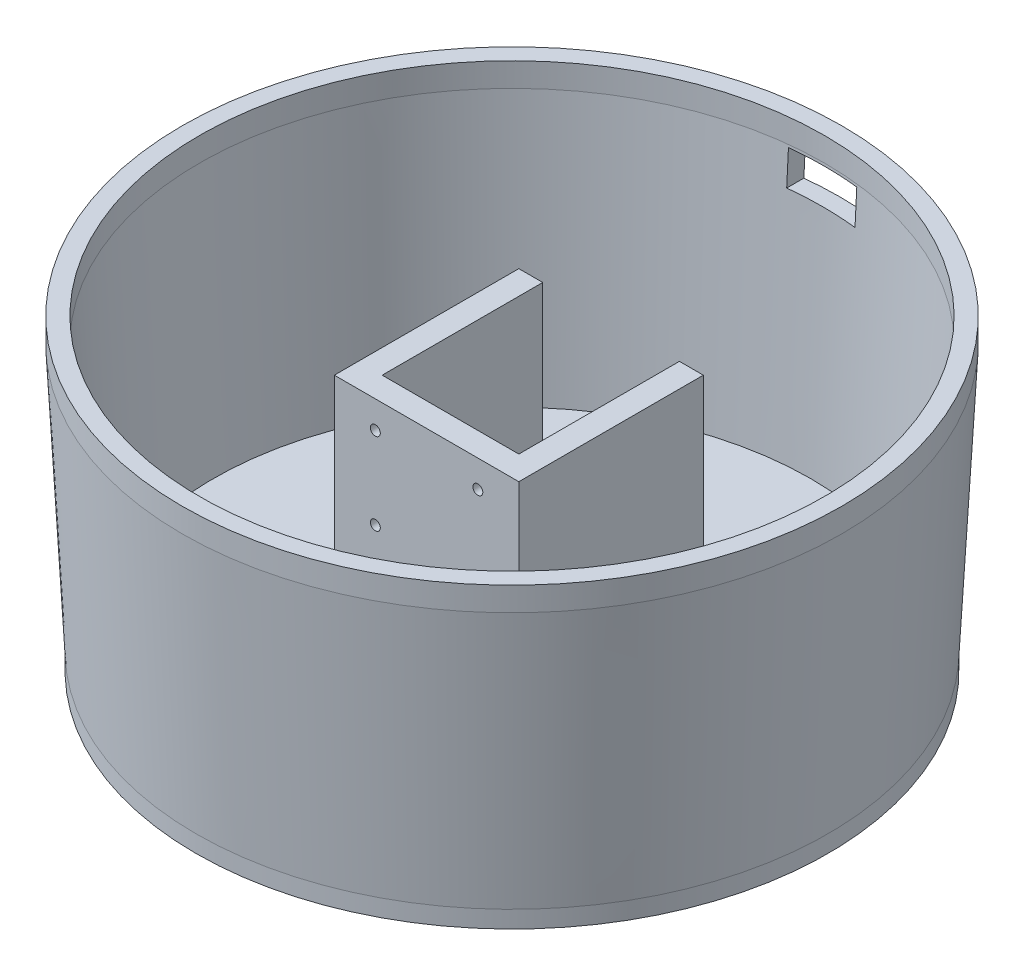
ISO-10303-21;
HEADER;
FILE_DESCRIPTION(('STEP AP214'),'2;1');
FILE_NAME('part.step','',(''),(''),'','','');
FILE_SCHEMA(('AUTOMOTIVE_DESIGN { 1 0 10303 214 1 1 1 1 }'));
ENDSEC;
DATA;
#1=APPLICATION_CONTEXT('core data for automotive mechanical design processes');
#2=APPLICATION_PROTOCOL_DEFINITION('international standard','automotive_design',2000,#1);
#3=PRODUCT_CONTEXT('',#1,'mechanical');
#4=PRODUCT('Part','Part','',(#3));
#5=PRODUCT_RELATED_PRODUCT_CATEGORY('part','',(#4));
#6=PRODUCT_DEFINITION_FORMATION('','',#4);
#7=PRODUCT_DEFINITION_CONTEXT('part definition',#1,'design');
#8=PRODUCT_DEFINITION('design','',#6,#7);
#9=PRODUCT_DEFINITION_SHAPE('','',#8);
#10=(LENGTH_UNIT() NAMED_UNIT(*) SI_UNIT(.MILLI.,.METRE.));
#11=(NAMED_UNIT(*) PLANE_ANGLE_UNIT() SI_UNIT($,.RADIAN.));
#12=(NAMED_UNIT(*) SI_UNIT($,.STERADIAN.) SOLID_ANGLE_UNIT());
#13=UNCERTAINTY_MEASURE_WITH_UNIT(LENGTH_MEASURE(1.E-05),#10,'distance_accuracy_value','');
#14=(GEOMETRIC_REPRESENTATION_CONTEXT(3) GLOBAL_UNCERTAINTY_ASSIGNED_CONTEXT((#13)) GLOBAL_UNIT_ASSIGNED_CONTEXT((#10,
#11,#12)) REPRESENTATION_CONTEXT('',''));
#15=CARTESIAN_POINT('',(0.,0.,0.));
#16=DIRECTION('',(0.,0.,1.));
#17=DIRECTION('',(1.,0.,0.));
#18=AXIS2_PLACEMENT_3D('',#15,#16,#17);
#19=CARTESIAN_POINT('',(0.,5.,0.));
#20=DIRECTION('',(0.,1.,0.));
#21=DIRECTION('',(0.,0.,1.));
#22=AXIS2_PLACEMENT_3D('',#19,#20,#21);
#23=PLANE('',#22);
#24=CARTESIAN_POINT('',(0.,5.,0.));
#25=DIRECTION('',(0.,1.,0.));
#26=DIRECTION('',(0.,0.,1.));
#27=AXIS2_PLACEMENT_3D('',#24,#25,#26);
#28=CIRCLE('',#27,15.2);
#29=CARTESIAN_POINT('',(0.,5.,15.2));
#30=VERTEX_POINT('',#29);
#31=EDGE_CURVE('E275',#30,#30,#28,.T.);
#32=ORIENTED_EDGE('',*,*,#31,.F.);
#33=EDGE_LOOP('',(#32));
#34=FACE_BOUND('',#33,.T.);
#35=CARTESIAN_POINT('',(0.,5.,0.));
#36=DIRECTION('',(0.,-1.,0.));
#37=DIRECTION('',(0.,0.,-1.));
#38=AXIS2_PLACEMENT_3D('',#35,#36,#37);
#39=CIRCLE('',#38,87.5);
#40=CARTESIAN_POINT('',(0.,5.,-87.5));
#41=VERTEX_POINT('',#40);
#42=EDGE_CURVE('E285',#41,#41,#39,.T.);
#43=ORIENTED_EDGE('',*,*,#42,.F.);
#44=EDGE_LOOP('',(#43));
#45=FACE_BOUND('',#44,.T.);
#46=DIRECTION('',(-1.,0.,0.));
#47=VECTOR('',#46,1.);
#48=CARTESIAN_POINT('',(-20.,5.,18.));
#49=LINE('',#48,#47);
#50=CARTESIAN_POINT('',(20.,5.,18.));
#51=VERTEX_POINT('',#50);
#52=CARTESIAN_POINT('',(-20.,5.,18.));
#53=VERTEX_POINT('',#52);
#54=EDGE_CURVE('E331',#51,#53,#49,.T.);
#55=ORIENTED_EDGE('',*,*,#54,.F.);
#56=DIRECTION('',(0.,0.,1.));
#57=VECTOR('',#56,1.);
#58=CARTESIAN_POINT('',(20.,5.,18.));
#59=LINE('',#58,#57);
#60=CARTESIAN_POINT('',(20.,5.,-29.));
#61=VERTEX_POINT('',#60);
#62=EDGE_CURVE('E334',#61,#51,#59,.T.);
#63=ORIENTED_EDGE('',*,*,#62,.F.);
#64=DIRECTION('',(-1.,0.,0.));
#65=VECTOR('',#64,1.);
#66=CARTESIAN_POINT('',(20.,5.,-29.));
#67=LINE('',#66,#65);
#68=CARTESIAN_POINT('',(27.,5.,-29.));
#69=VERTEX_POINT('',#68);
#70=EDGE_CURVE('E313',#69,#61,#67,.T.);
#71=ORIENTED_EDGE('',*,*,#70,.F.);
#72=DIRECTION('',(0.,0.,-1.));
#73=VECTOR('',#72,1.);
#74=CARTESIAN_POINT('',(27.,5.,25.));
#75=LINE('',#74,#73);
#76=CARTESIAN_POINT('',(27.,5.,25.));
#77=VERTEX_POINT('',#76);
#78=EDGE_CURVE('E316',#77,#69,#75,.T.);
#79=ORIENTED_EDGE('',*,*,#78,.F.);
#80=DIRECTION('',(1.,0.,0.));
#81=VECTOR('',#80,1.);
#82=CARTESIAN_POINT('',(20.,5.,25.));
#83=LINE('',#82,#81);
#84=CARTESIAN_POINT('',(-27.,5.,25.));
#85=VERTEX_POINT('',#84);
#86=EDGE_CURVE('E319',#85,#77,#83,.T.);
#87=ORIENTED_EDGE('',*,*,#86,.F.);
#88=DIRECTION('',(0.,0.,1.));
#89=VECTOR('',#88,1.);
#90=CARTESIAN_POINT('',(-27.,5.,25.));
#91=LINE('',#90,#89);
#92=CARTESIAN_POINT('',(-27.,5.,-29.));
#93=VERTEX_POINT('',#92);
#94=EDGE_CURVE('E322',#93,#85,#91,.T.);
#95=ORIENTED_EDGE('',*,*,#94,.F.);
#96=DIRECTION('',(-1.,0.,0.));
#97=VECTOR('',#96,1.);
#98=CARTESIAN_POINT('',(-20.,5.,-29.));
#99=LINE('',#98,#97);
#100=CARTESIAN_POINT('',(-20.,5.,-29.));
#101=VERTEX_POINT('',#100);
#102=EDGE_CURVE('E325',#101,#93,#99,.T.);
#103=ORIENTED_EDGE('',*,*,#102,.F.);
#104=DIRECTION('',(0.,0.,-1.));
#105=VECTOR('',#104,1.);
#106=CARTESIAN_POINT('',(-20.,5.,18.));
#107=LINE('',#106,#105);
#108=EDGE_CURVE('E328',#53,#101,#107,.T.);
#109=ORIENTED_EDGE('',*,*,#108,.F.);
#110=EDGE_LOOP('',(#55,#63,#71,#79,#87,#95,#103,#109));
#111=FACE_BOUND('',#110,.T.);
#112=ADVANCED_FACE('F37',(#34,#45,#111),#23,.T.);
#113=CARTESIAN_POINT('',(0.,0.,0.));
#114=DIRECTION('',(0.,1.,0.));
#115=DIRECTION('',(0.,0.,1.));
#116=AXIS2_PLACEMENT_3D('',#113,#114,#115);
#117=PLANE('',#116);
#118=CARTESIAN_POINT('',(0.,0.,0.));
#119=DIRECTION('',(0.,1.,0.));
#120=DIRECTION('',(0.,0.,1.));
#121=AXIS2_PLACEMENT_3D('',#118,#119,#120);
#122=CIRCLE('',#121,92.5);
#123=CARTESIAN_POINT('',(0.,0.,92.5));
#124=VERTEX_POINT('',#123);
#125=EDGE_CURVE('E271',#124,#124,#122,.T.);
#126=ORIENTED_EDGE('',*,*,#125,.F.);
#127=EDGE_LOOP('',(#126));
#128=FACE_BOUND('',#127,.T.);
#129=CARTESIAN_POINT('',(0.,0.,0.));
#130=DIRECTION('',(0.,1.,0.));
#131=DIRECTION('',(0.,0.,1.));
#132=AXIS2_PLACEMENT_3D('',#129,#130,#131);
#133=CIRCLE('',#132,15.2);
#134=CARTESIAN_POINT('',(0.,0.,15.2));
#135=VERTEX_POINT('',#134);
#136=EDGE_CURVE('E277',#135,#135,#133,.T.);
#137=ORIENTED_EDGE('',*,*,#136,.T.);
#138=EDGE_LOOP('',(#137));
#139=FACE_BOUND('',#138,.T.);
#140=ADVANCED_FACE('F395',(#128,#139),#117,.F.);
#141=CARTESIAN_POINT('',(0.,5.,0.));
#142=DIRECTION('',(0.,-1.,0.));
#143=DIRECTION('',(0.,0.,-1.));
#144=AXIS2_PLACEMENT_3D('',#141,#142,#143);
#145=CYLINDRICAL_SURFACE('',#144,92.5);
#146=CARTESIAN_POINT('',(0.,5.,0.));
#147=DIRECTION('',(0.,1.,0.));
#148=DIRECTION('',(0.,0.,1.));
#149=AXIS2_PLACEMENT_3D('',#146,#147,#148);
#150=CIRCLE('',#149,92.5);
#151=CARTESIAN_POINT('',(0.,5.,92.5));
#152=VERTEX_POINT('',#151);
#153=EDGE_CURVE('E267',#152,#152,#150,.T.);
#154=ORIENTED_EDGE('',*,*,#153,.F.);
#155=EDGE_LOOP('',(#154));
#156=FACE_BOUND('',#155,.T.);
#157=ORIENTED_EDGE('',*,*,#125,.T.);
#158=EDGE_LOOP('',(#157));
#159=FACE_BOUND('',#158,.T.);
#160=ADVANCED_FACE('F39',(#156,#159),#145,.T.);
#161=CARTESIAN_POINT('',(0.,5.,0.));
#162=DIRECTION('',(0.,-1.,0.));
#163=DIRECTION('',(0.,0.,-1.));
#164=AXIS2_PLACEMENT_3D('',#161,#162,#163);
#165=CYLINDRICAL_SURFACE('',#164,15.2);
#166=ORIENTED_EDGE('',*,*,#31,.T.);
#167=EDGE_LOOP('',(#166));
#168=FACE_BOUND('',#167,.T.);
#169=ORIENTED_EDGE('',*,*,#136,.F.);
#170=EDGE_LOOP('',(#169));
#171=FACE_BOUND('',#170,.T.);
#172=ADVANCED_FACE('F404',(#168,#171),#165,.F.);
#173=CARTESIAN_POINT('',(0.,83.,0.));
#174=DIRECTION('',(0.,1.,0.));
#175=DIRECTION('',(0.,0.,1.));
#176=AXIS2_PLACEMENT_3D('',#173,#174,#175);
#177=CONICAL_SURFACE('',#176,96.5,0.0512371674034189);
#178=CARTESIAN_POINT('',(0.,72.2288877427624,0.));
#179=DIRECTION('',(0.,-1.,0.));
#180=DIRECTION('',(0.,0.,-1.));
#181=AXIS2_PLACEMENT_3D('',#178,#179,#180);
#182=CIRCLE('',#181,95.9476352688596);
#183=CARTESIAN_POINT('',(-10.,72.2288877427624,-95.4250947795501));
#184=VERTEX_POINT('',#183);
#185=CARTESIAN_POINT('',(10.,72.2288877427624,-95.4250947795501));
#186=VERTEX_POINT('',#185);
#187=EDGE_CURVE('E147',#184,#186,#182,.T.);
#188=ORIENTED_EDGE('',*,*,#187,.T.);
#189=CARTESIAN_POINT('',(10.,-24.7880633881634,-90.4211194158596));
#190=CARTESIAN_POINT('',(10.,4.02037428882019,-91.9074785119461));
#191=CARTESIAN_POINT('',(10.,32.8288343490186,-93.3934037264379));
#192=CARTESIAN_POINT('',(10.,90.4457939736951,-96.3644878674129));
#193=CARTESIAN_POINT('',(10.,119.254293538173,-97.8496467938965));
#194=CARTESIAN_POINT('',(10.,158.457150925008,-99.8702104676842));
#195=CARTESIAN_POINT('',(10.,168.851493845891,-100.405904347476));
#196=CARTESIAN_POINT('',(10.,179.245838873688,-100.941557337092));
#197=B_SPLINE_CURVE_WITH_KNOTS('',3,(#189,#190,#191,#192,#193,#194,#195,#196),.UNSPECIFIED.,.F.,
.F.,(4,2,2,4),(0.,86.5402686703959,173.080537308779,204.304950740835),.UNSPECIFIED.);
#198=CARTESIAN_POINT('',(10.,82.2288877427624,-95.9407084068565));
#199=VERTEX_POINT('',#198);
#200=EDGE_CURVE('E140',#186,#199,#197,.T.);
#201=ORIENTED_EDGE('',*,*,#200,.T.);
#202=CARTESIAN_POINT('',(0.,82.2288877427624,0.));
#203=DIRECTION('',(0.,1.,0.));
#204=DIRECTION('',(0.,0.,1.));
#205=AXIS2_PLACEMENT_3D('',#202,#203,#204);
#206=CIRCLE('',#205,96.4604557816801);
#207=CARTESIAN_POINT('',(-10.,82.2288877427624,-95.9407084068565));
#208=VERTEX_POINT('',#207);
#209=EDGE_CURVE('E129',#199,#208,#206,.T.);
#210=ORIENTED_EDGE('',*,*,#209,.T.);
#211=CARTESIAN_POINT('',(-10.,179.245838873688,-100.941557337092));
#212=CARTESIAN_POINT('',(-10.,162.242988244134,-100.065347640187));
#213=CARTESIAN_POINT('',(-10.,145.240143279058,-99.1890280187472));
#214=CARTESIAN_POINT('',(-10.,111.234465701809,-97.4361492093273));
#215=CARTESIAN_POINT('',(-10.,94.2316330896367,-96.5595900213473));
#216=CARTESIAN_POINT('',(-10.,60.2259812335582,-94.8062123609349));
#217=CARTESIAN_POINT('',(-10.,43.2231619896519,-93.9293938885026));
#218=CARTESIAN_POINT('',(-10.,9.21753807140102,-92.1754743873053));
#219=CARTESIAN_POINT('',(-10.,-7.78526660294361,-91.2983733585403));
#220=CARTESIAN_POINT('',(-10.,-24.7880633881635,-90.4211194158596));
#221=B_SPLINE_CURVE_WITH_KNOTS('',3,(#211,#212,#213,#214,#215,#216,#217,#218,#219,#220),
.UNSPECIFIED.,.F.,.F.,(4,2,2,2,4),(0.,51.0762376911101,102.152475370222,153.228713051131,
204.304950744042),.UNSPECIFIED.);
#222=EDGE_CURVE('E134',#208,#184,#221,.T.);
#223=ORIENTED_EDGE('',*,*,#222,.T.);
#224=EDGE_LOOP('',(#188,#201,#210,#223));
#225=FACE_BOUND('',#224,.T.);
#226=ORIENTED_EDGE('',*,*,#153,.T.);
#227=EDGE_LOOP('',(#226));
#228=FACE_BOUND('',#227,.T.);
#229=CARTESIAN_POINT('',(0.,83.,0.));
#230=DIRECTION('',(0.,-1.,0.));
#231=DIRECTION('',(0.,0.,-1.));
#232=AXIS2_PLACEMENT_3D('',#229,#230,#231);
#233=CIRCLE('',#232,96.5);
#234=CARTESIAN_POINT('',(0.,83.,-96.5));
#235=VERTEX_POINT('',#234);
#236=EDGE_CURVE('E294',#235,#235,#233,.T.);
#237=ORIENTED_EDGE('',*,*,#236,.T.);
#238=EDGE_LOOP('',(#237));
#239=FACE_BOUND('',#238,.T.);
#240=ADVANCED_FACE('F145',(#225,#228,#239),#177,.T.);
#241=CARTESIAN_POINT('',(0.,5.,0.));
#242=DIRECTION('',(0.,1.,0.));
#243=DIRECTION('',(0.,0.,1.));
#244=AXIS2_PLACEMENT_3D('',#241,#242,#243);
#245=CONICAL_SURFACE('',#244,87.5,0.0512371674034192);
#246=CARTESIAN_POINT('',(0.,82.2288877427624,0.));
#247=DIRECTION('',(0.,1.,0.));
#248=DIRECTION('',(0.,0.,1.));
#249=AXIS2_PLACEMENT_3D('',#246,#247,#248);
#250=CIRCLE('',#249,91.4604557816801);
#251=CARTESIAN_POINT('',(-10.,82.2288877427624,-90.9121277486819));
#252=VERTEX_POINT('',#251);
#253=CARTESIAN_POINT('',(10.,82.2288877427624,-90.9121277486819));
#254=VERTEX_POINT('',#253);
#255=EDGE_CURVE('E245',#252,#254,#250,.F.);
#256=ORIENTED_EDGE('',*,*,#255,.T.);
#257=CARTESIAN_POINT('',(10.,174.273913778776,-95.659446238128));
#258=CARTESIAN_POINT('',(10.,158.099715693123,-94.825480008073));
#259=CARTESIAN_POINT('',(10.,141.925523633053,-93.9913969096422));
#260=CARTESIAN_POINT('',(10.,109.577152659725,-92.3229759077973));
#261=CARTESIAN_POINT('',(10.,93.4029737464677,-91.4886380043832));
#262=CARTESIAN_POINT('',(10.,61.0546301521894,-89.8196863238129));
#263=CARTESIAN_POINT('',(10.,44.8804654711687,-88.9850725466566));
#264=CARTESIAN_POINT('',(10.,12.5321516269733,-87.3155442320194));
#265=CARTESIAN_POINT('',(10.,-3.64199753620151,-86.4806296945383));
#266=CARTESIAN_POINT('',(10.,-19.8161382932512,-85.6455523338306));
#267=B_SPLINE_CURVE_WITH_KNOTS('',3,(#257,#258,#259,#260,#261,#262,#263,#264,#265,#266),
.UNSPECIFIED.,.F.,.F.,(4,2,2,2,4),(0.,48.5870522926203,97.1741045709608,145.761156851449,
194.348209146221),.UNSPECIFIED.);
#268=CARTESIAN_POINT('',(10.,72.2288877427624,-90.3961966069232));
#269=VERTEX_POINT('',#268);
#270=EDGE_CURVE('E11',#254,#269,#267,.T.);
#271=ORIENTED_EDGE('',*,*,#270,.T.);
#272=CARTESIAN_POINT('',(0.,72.2288877427624,0.));
#273=DIRECTION('',(0.,-1.,0.));
#274=DIRECTION('',(0.,0.,-1.));
#275=AXIS2_PLACEMENT_3D('',#272,#273,#274);
#276=CIRCLE('',#275,90.9476352688596);
#277=CARTESIAN_POINT('',(-10.,72.2288877427624,-90.3961966069232));
#278=VERTEX_POINT('',#277);
#279=EDGE_CURVE('E51',#269,#278,#276,.F.);
#280=ORIENTED_EDGE('',*,*,#279,.T.);
#281=CARTESIAN_POINT('',(-10.,-19.8161382932512,-85.6455523338306));
#282=CARTESIAN_POINT('',(-10.,7.4896299992404,-87.0553567162511));
#283=CARTESIAN_POINT('',(-10.,34.7954219694276,-88.4647024351024));
#284=CARTESIAN_POINT('',(-10.,89.4070476916133,-91.2825838907864));
#285=CARTESIAN_POINT('',(-10.,116.712881443612,-92.6911196276196));
#286=CARTESIAN_POINT('',(-10.,154.103791043206,-94.6193984656074));
#287=CARTESIAN_POINT('',(-10.,164.188851245385,-95.1394449613985));
#288=CARTESIAN_POINT('',(-10.,174.273913778776,-95.659446238128));
#289=B_SPLINE_CURVE_WITH_KNOTS('',3,(#281,#282,#283,#284,#285,#286,#287,#288),.UNSPECIFIED.,.F.,
.F.,(4,2,2,4),(0.,82.0264150904637,164.052830143088,194.348209142456),.UNSPECIFIED.);
#290=EDGE_CURVE('E238',#278,#252,#289,.T.);
#291=ORIENTED_EDGE('',*,*,#290,.T.);
#292=EDGE_LOOP('',(#256,#271,#280,#291));
#293=FACE_BOUND('',#292,.T.);
#294=CARTESIAN_POINT('',(0.,83.,0.));
#295=DIRECTION('',(0.,-1.,0.));
#296=DIRECTION('',(0.,0.,-1.));
#297=AXIS2_PLACEMENT_3D('',#294,#295,#296);
#298=CIRCLE('',#297,91.5);
#299=CARTESIAN_POINT('',(0.,83.,-91.5));
#300=VERTEX_POINT('',#299);
#301=EDGE_CURVE('E280',#300,#300,#298,.T.);
#302=ORIENTED_EDGE('',*,*,#301,.F.);
#303=EDGE_LOOP('',(#302));
#304=FACE_BOUND('',#303,.T.);
#305=ORIENTED_EDGE('',*,*,#42,.T.);
#306=EDGE_LOOP('',(#305));
#307=FACE_BOUND('',#306,.T.);
#308=ADVANCED_FACE('F231',(#293,#304,#307),#245,.F.);
#309=CARTESIAN_POINT('',(0.,0.,0.));
#310=DIRECTION('',(0.,-1.,0.));
#311=DIRECTION('',(0.,0.,-1.));
#312=AXIS2_PLACEMENT_3D('',#309,#310,#311);
#313=CYLINDRICAL_SURFACE('',#312,91.5);
#314=CARTESIAN_POINT('',(0.,90.,0.));
#315=DIRECTION('',(0.,-1.,0.));
#316=DIRECTION('',(0.,0.,-1.));
#317=AXIS2_PLACEMENT_3D('',#314,#315,#316);
#318=CIRCLE('',#317,91.5);
#319=CARTESIAN_POINT('',(0.,90.,-91.5));
#320=VERTEX_POINT('',#319);
#321=EDGE_CURVE('E288',#320,#320,#318,.T.);
#322=ORIENTED_EDGE('',*,*,#321,.F.);
#323=EDGE_LOOP('',(#322));
#324=FACE_BOUND('',#323,.T.);
#325=ORIENTED_EDGE('',*,*,#301,.T.);
#326=EDGE_LOOP('',(#325));
#327=FACE_BOUND('',#326,.T.);
#328=ADVANCED_FACE('F228',(#324,#327),#313,.F.);
#329=CARTESIAN_POINT('',(-91.5,90.,0.));
#330=DIRECTION('',(0.,-1.,0.));
#331=DIRECTION('',(0.,0.,-1.));
#332=AXIS2_PLACEMENT_3D('',#329,#330,#331);
#333=PLANE('',#332);
#334=CARTESIAN_POINT('',(0.,90.,0.));
#335=DIRECTION('',(0.,-1.,0.));
#336=DIRECTION('',(0.,0.,-1.));
#337=AXIS2_PLACEMENT_3D('',#334,#335,#336);
#338=CIRCLE('',#337,96.5);
#339=CARTESIAN_POINT('',(0.,90.,-96.5));
#340=VERTEX_POINT('',#339);
#341=EDGE_CURVE('E291',#340,#340,#338,.T.);
#342=ORIENTED_EDGE('',*,*,#341,.F.);
#343=EDGE_LOOP('',(#342));
#344=FACE_BOUND('',#343,.T.);
#345=ORIENTED_EDGE('',*,*,#321,.T.);
#346=EDGE_LOOP('',(#345));
#347=FACE_BOUND('',#346,.T.);
#348=ADVANCED_FACE('F224',(#344,#347),#333,.F.);
#349=CARTESIAN_POINT('',(0.,0.,0.));
#350=DIRECTION('',(0.,-1.,0.));
#351=DIRECTION('',(0.,0.,-1.));
#352=AXIS2_PLACEMENT_3D('',#349,#350,#351);
#353=CYLINDRICAL_SURFACE('',#352,96.5);
#354=ORIENTED_EDGE('',*,*,#236,.F.);
#355=EDGE_LOOP('',(#354));
#356=FACE_BOUND('',#355,.T.);
#357=ORIENTED_EDGE('',*,*,#341,.T.);
#358=EDGE_LOOP('',(#357));
#359=FACE_BOUND('',#358,.T.);
#360=ADVANCED_FACE('F220',(#356,#359),#353,.T.);
#361=CARTESIAN_POINT('',(20.,90.,18.));
#362=DIRECTION('',(1.,0.,0.));
#363=DIRECTION('',(0.,0.,-1.));
#364=AXIS2_PLACEMENT_3D('',#361,#362,#363);
#365=PLANE('',#364);
#366=DIRECTION('',(0.,-1.,0.));
#367=VECTOR('',#366,1.);
#368=CARTESIAN_POINT('',(20.,90.,18.));
#369=LINE('',#368,#367);
#370=CARTESIAN_POINT('',(20.,74.,18.));
#371=VERTEX_POINT('',#370);
#372=EDGE_CURVE('E297',#371,#51,#369,.T.);
#373=ORIENTED_EDGE('',*,*,#372,.F.);
#374=DIRECTION('',(0.,0.,-1.));
#375=VECTOR('',#374,1.);
#376=CARTESIAN_POINT('',(20.,74.,18.));
#377=LINE('',#376,#375);
#378=CARTESIAN_POINT('',(20.,74.,-29.));
#379=VERTEX_POINT('',#378);
#380=EDGE_CURVE('E370',#371,#379,#377,.T.);
#381=ORIENTED_EDGE('',*,*,#380,.T.);
#382=DIRECTION('',(0.,-1.,0.));
#383=VECTOR('',#382,1.);
#384=CARTESIAN_POINT('',(20.,90.,-29.));
#385=LINE('',#384,#383);
#386=EDGE_CURVE('E311',#379,#61,#385,.T.);
#387=ORIENTED_EDGE('',*,*,#386,.T.);
#388=ORIENTED_EDGE('',*,*,#62,.T.);
#389=EDGE_LOOP('',(#373,#381,#387,#388));
#390=FACE_BOUND('',#389,.T.);
#391=ADVANCED_FACE('F216',(#390),#365,.F.);
#392=CARTESIAN_POINT('',(-20.,90.,18.));
#393=DIRECTION('',(0.,0.,1.));
#394=DIRECTION('',(1.,0.,0.));
#395=AXIS2_PLACEMENT_3D('',#392,#393,#394);
#396=PLANE('',#395);
#397=CARTESIAN_POINT('',(15.,66.,18.));
#398=DIRECTION('',(0.,0.,1.));
#399=DIRECTION('',(1.,0.,0.));
#400=AXIS2_PLACEMENT_3D('',#397,#398,#399);
#401=CIRCLE('',#400,1.45);
#402=CARTESIAN_POINT('',(16.45,66.,18.));
#403=VERTEX_POINT('',#402);
#404=EDGE_CURVE('E337',#403,#403,#401,.T.);
#405=ORIENTED_EDGE('',*,*,#404,.T.);
#406=EDGE_LOOP('',(#405));
#407=FACE_BOUND('',#406,.T.);
#408=CARTESIAN_POINT('',(-15.,66.,18.));
#409=DIRECTION('',(0.,0.,1.));
#410=DIRECTION('',(1.,0.,0.));
#411=AXIS2_PLACEMENT_3D('',#408,#409,#410);
#412=CIRCLE('',#411,1.45);
#413=CARTESIAN_POINT('',(-13.55,66.,18.));
#414=VERTEX_POINT('',#413);
#415=EDGE_CURVE('E340',#414,#414,#412,.T.);
#416=ORIENTED_EDGE('',*,*,#415,.T.);
#417=EDGE_LOOP('',(#416));
#418=FACE_BOUND('',#417,.T.);
#419=CARTESIAN_POINT('',(-15.,42.,18.));
#420=DIRECTION('',(0.,0.,1.));
#421=DIRECTION('',(1.,0.,0.));
#422=AXIS2_PLACEMENT_3D('',#419,#420,#421);
#423=CIRCLE('',#422,1.45);
#424=CARTESIAN_POINT('',(-13.55,42.,18.));
#425=VERTEX_POINT('',#424);
#426=EDGE_CURVE('E343',#425,#425,#423,.T.);
#427=ORIENTED_EDGE('',*,*,#426,.T.);
#428=EDGE_LOOP('',(#427));
#429=FACE_BOUND('',#428,.T.);
#430=CARTESIAN_POINT('',(15.,42.,18.));
#431=DIRECTION('',(0.,0.,1.));
#432=DIRECTION('',(1.,0.,0.));
#433=AXIS2_PLACEMENT_3D('',#430,#431,#432);
#434=CIRCLE('',#433,1.45);
#435=CARTESIAN_POINT('',(16.45,42.,18.));
#436=VERTEX_POINT('',#435);
#437=EDGE_CURVE('E346',#436,#436,#434,.T.);
#438=ORIENTED_EDGE('',*,*,#437,.T.);
#439=EDGE_LOOP('',(#438));
#440=FACE_BOUND('',#439,.T.);
#441=DIRECTION('',(0.,-1.,0.));
#442=VECTOR('',#441,1.);
#443=CARTESIAN_POINT('',(-20.,90.,18.));
#444=LINE('',#443,#442);
#445=CARTESIAN_POINT('',(-20.,74.,18.));
#446=VERTEX_POINT('',#445);
#447=EDGE_CURVE('E299',#446,#53,#444,.T.);
#448=ORIENTED_EDGE('',*,*,#447,.F.);
#449=DIRECTION('',(1.,0.,0.));
#450=VECTOR('',#449,1.);
#451=CARTESIAN_POINT('',(-20.,74.,18.));
#452=LINE('',#451,#450);
#453=EDGE_CURVE('E367',#446,#371,#452,.T.);
#454=ORIENTED_EDGE('',*,*,#453,.T.);
#455=ORIENTED_EDGE('',*,*,#372,.T.);
#456=ORIENTED_EDGE('',*,*,#54,.T.);
#457=EDGE_LOOP('',(#448,#454,#455,#456));
#458=FACE_BOUND('',#457,.T.);
#459=ADVANCED_FACE('F212',(#407,#418,#429,#440,#458),#396,.F.);
#460=CARTESIAN_POINT('',(-20.,90.,18.));
#461=DIRECTION('',(-1.,0.,0.));
#462=DIRECTION('',(0.,0.,1.));
#463=AXIS2_PLACEMENT_3D('',#460,#461,#462);
#464=PLANE('',#463);
#465=DIRECTION('',(0.,-1.,0.));
#466=VECTOR('',#465,1.);
#467=CARTESIAN_POINT('',(-20.,90.,-29.));
#468=LINE('',#467,#466);
#469=CARTESIAN_POINT('',(-20.,74.,-29.));
#470=VERTEX_POINT('',#469);
#471=EDGE_CURVE('E301',#470,#101,#468,.T.);
#472=ORIENTED_EDGE('',*,*,#471,.F.);
#473=DIRECTION('',(0.,0.,1.));
#474=VECTOR('',#473,1.);
#475=CARTESIAN_POINT('',(-20.,74.,18.));
#476=LINE('',#475,#474);
#477=EDGE_CURVE('E364',#470,#446,#476,.T.);
#478=ORIENTED_EDGE('',*,*,#477,.T.);
#479=ORIENTED_EDGE('',*,*,#447,.T.);
#480=ORIENTED_EDGE('',*,*,#108,.T.);
#481=EDGE_LOOP('',(#472,#478,#479,#480));
#482=FACE_BOUND('',#481,.T.);
#483=ADVANCED_FACE('F208',(#482),#464,.F.);
#484=CARTESIAN_POINT('',(-20.,90.,-29.));
#485=DIRECTION('',(0.,0.,1.));
#486=DIRECTION('',(1.,0.,0.));
#487=AXIS2_PLACEMENT_3D('',#484,#485,#486);
#488=PLANE('',#487);
#489=DIRECTION('',(0.,-1.,0.));
#490=VECTOR('',#489,1.);
#491=CARTESIAN_POINT('',(-27.,90.,-29.));
#492=LINE('',#491,#490);
#493=CARTESIAN_POINT('',(-27.,74.,-29.));
#494=VERTEX_POINT('',#493);
#495=EDGE_CURVE('E303',#494,#93,#492,.T.);
#496=ORIENTED_EDGE('',*,*,#495,.F.);
#497=DIRECTION('',(1.,0.,0.));
#498=VECTOR('',#497,1.);
#499=CARTESIAN_POINT('',(-20.,74.,-29.));
#500=LINE('',#499,#498);
#501=EDGE_CURVE('E357',#494,#470,#500,.T.);
#502=ORIENTED_EDGE('',*,*,#501,.T.);
#503=ORIENTED_EDGE('',*,*,#471,.T.);
#504=ORIENTED_EDGE('',*,*,#102,.T.);
#505=EDGE_LOOP('',(#496,#502,#503,#504));
#506=FACE_BOUND('',#505,.T.);
#507=ADVANCED_FACE('F204',(#506),#488,.F.);
#508=CARTESIAN_POINT('',(-27.,90.,25.));
#509=DIRECTION('',(1.,0.,0.));
#510=DIRECTION('',(0.,0.,-1.));
#511=AXIS2_PLACEMENT_3D('',#508,#509,#510);
#512=PLANE('',#511);
#513=DIRECTION('',(0.,-1.,0.));
#514=VECTOR('',#513,1.);
#515=CARTESIAN_POINT('',(-27.,90.,25.));
#516=LINE('',#515,#514);
#517=CARTESIAN_POINT('',(-27.,74.,25.));
#518=VERTEX_POINT('',#517);
#519=EDGE_CURVE('E305',#518,#85,#516,.T.);
#520=ORIENTED_EDGE('',*,*,#519,.F.);
#521=DIRECTION('',(0.,0.,1.));
#522=VECTOR('',#521,1.);
#523=CARTESIAN_POINT('',(-27.,74.,-60.));
#524=LINE('',#523,#522);
#525=EDGE_CURVE('E150',#494,#518,#524,.T.);
#526=ORIENTED_EDGE('',*,*,#525,.F.);
#527=ORIENTED_EDGE('',*,*,#495,.T.);
#528=ORIENTED_EDGE('',*,*,#94,.T.);
#529=EDGE_LOOP('',(#520,#526,#527,#528));
#530=FACE_BOUND('',#529,.T.);
#531=ADVANCED_FACE('F200',(#530),#512,.F.);
#532=CARTESIAN_POINT('',(20.,90.,25.));
#533=DIRECTION('',(0.,0.,-1.));
#534=DIRECTION('',(-1.,0.,0.));
#535=AXIS2_PLACEMENT_3D('',#532,#533,#534);
#536=PLANE('',#535);
#537=CARTESIAN_POINT('',(15.,66.,25.));
#538=DIRECTION('',(0.,0.,1.));
#539=DIRECTION('',(-1.,0.,0.));
#540=AXIS2_PLACEMENT_3D('',#537,#538,#539);
#541=CIRCLE('',#540,1.45);
#542=CARTESIAN_POINT('',(13.55,66.,25.));
#543=VERTEX_POINT('',#542);
#544=EDGE_CURVE('E353',#543,#543,#541,.T.);
#545=ORIENTED_EDGE('',*,*,#544,.F.);
#546=EDGE_LOOP('',(#545));
#547=FACE_BOUND('',#546,.T.);
#548=CARTESIAN_POINT('',(-15.,66.,25.));
#549=DIRECTION('',(0.,0.,1.));
#550=DIRECTION('',(1.,0.,0.));
#551=AXIS2_PLACEMENT_3D('',#548,#549,#550);
#552=CIRCLE('',#551,1.45);
#553=CARTESIAN_POINT('',(-13.55,66.,25.));
#554=VERTEX_POINT('',#553);
#555=EDGE_CURVE('E356',#554,#554,#552,.T.);
#556=ORIENTED_EDGE('',*,*,#555,.F.);
#557=EDGE_LOOP('',(#556));
#558=FACE_BOUND('',#557,.T.);
#559=CARTESIAN_POINT('',(-15.,42.,25.));
#560=DIRECTION('',(0.,0.,1.));
#561=DIRECTION('',(-1.,0.,0.));
#562=AXIS2_PLACEMENT_3D('',#559,#560,#561);
#563=CIRCLE('',#562,1.45);
#564=CARTESIAN_POINT('',(-16.45,42.,25.));
#565=VERTEX_POINT('',#564);
#566=EDGE_CURVE('E352',#565,#565,#563,.T.);
#567=ORIENTED_EDGE('',*,*,#566,.F.);
#568=EDGE_LOOP('',(#567));
#569=FACE_BOUND('',#568,.T.);
#570=CARTESIAN_POINT('',(15.,42.,25.));
#571=DIRECTION('',(0.,0.,1.));
#572=DIRECTION('',(1.,0.,0.));
#573=AXIS2_PLACEMENT_3D('',#570,#571,#572);
#574=CIRCLE('',#573,1.45);
#575=CARTESIAN_POINT('',(16.45,42.,25.));
#576=VERTEX_POINT('',#575);
#577=EDGE_CURVE('E349',#576,#576,#574,.T.);
#578=ORIENTED_EDGE('',*,*,#577,.F.);
#579=EDGE_LOOP('',(#578));
#580=FACE_BOUND('',#579,.T.);
#581=DIRECTION('',(0.,-1.,0.));
#582=VECTOR('',#581,1.);
#583=CARTESIAN_POINT('',(27.,90.,25.));
#584=LINE('',#583,#582);
#585=CARTESIAN_POINT('',(27.,74.,25.));
#586=VERTEX_POINT('',#585);
#587=EDGE_CURVE('E307',#586,#77,#584,.T.);
#588=ORIENTED_EDGE('',*,*,#587,.F.);
#589=DIRECTION('',(1.,0.,0.));
#590=VECTOR('',#589,1.);
#591=CARTESIAN_POINT('',(-27.,74.,25.));
#592=LINE('',#591,#590);
#593=EDGE_CURVE('E148',#518,#586,#592,.T.);
#594=ORIENTED_EDGE('',*,*,#593,.F.);
#595=ORIENTED_EDGE('',*,*,#519,.T.);
#596=ORIENTED_EDGE('',*,*,#86,.T.);
#597=EDGE_LOOP('',(#588,#594,#595,#596));
#598=FACE_BOUND('',#597,.T.);
#599=ADVANCED_FACE('F196',(#547,#558,#569,#580,#598),#536,.F.);
#600=CARTESIAN_POINT('',(27.,90.,25.));
#601=DIRECTION('',(-1.,0.,0.));
#602=DIRECTION('',(0.,0.,1.));
#603=AXIS2_PLACEMENT_3D('',#600,#601,#602);
#604=PLANE('',#603);
#605=DIRECTION('',(0.,-1.,0.));
#606=VECTOR('',#605,1.);
#607=CARTESIAN_POINT('',(27.,90.,-29.));
#608=LINE('',#607,#606);
#609=CARTESIAN_POINT('',(27.,74.,-29.));
#610=VERTEX_POINT('',#609);
#611=EDGE_CURVE('E309',#610,#69,#608,.T.);
#612=ORIENTED_EDGE('',*,*,#611,.F.);
#613=DIRECTION('',(0.,0.,1.));
#614=VECTOR('',#613,1.);
#615=CARTESIAN_POINT('',(27.,74.,-60.));
#616=LINE('',#615,#614);
#617=EDGE_CURVE('E373',#610,#586,#616,.T.);
#618=ORIENTED_EDGE('',*,*,#617,.T.);
#619=ORIENTED_EDGE('',*,*,#587,.T.);
#620=ORIENTED_EDGE('',*,*,#78,.T.);
#621=EDGE_LOOP('',(#612,#618,#619,#620));
#622=FACE_BOUND('',#621,.T.);
#623=ADVANCED_FACE('F192',(#622),#604,.F.);
#624=CARTESIAN_POINT('',(20.,90.,-29.));
#625=DIRECTION('',(0.,0.,1.));
#626=DIRECTION('',(1.,0.,0.));
#627=AXIS2_PLACEMENT_3D('',#624,#625,#626);
#628=PLANE('',#627);
#629=ORIENTED_EDGE('',*,*,#386,.F.);
#630=DIRECTION('',(1.,0.,0.));
#631=VECTOR('',#630,1.);
#632=CARTESIAN_POINT('',(20.,74.,-29.));
#633=LINE('',#632,#631);
#634=EDGE_CURVE('E265',#379,#610,#633,.T.);
#635=ORIENTED_EDGE('',*,*,#634,.T.);
#636=ORIENTED_EDGE('',*,*,#611,.T.);
#637=ORIENTED_EDGE('',*,*,#70,.T.);
#638=EDGE_LOOP('',(#629,#635,#636,#637));
#639=FACE_BOUND('',#638,.T.);
#640=ADVANCED_FACE('F188',(#639),#628,.F.);
#641=CARTESIAN_POINT('',(15.,42.,-60.));
#642=DIRECTION('',(0.,0.,1.));
#643=DIRECTION('',(1.,0.,0.));
#644=AXIS2_PLACEMENT_3D('',#641,#642,#643);
#645=CYLINDRICAL_SURFACE('',#644,1.45);
#646=ORIENTED_EDGE('',*,*,#577,.T.);
#647=EDGE_LOOP('',(#646));
#648=FACE_BOUND('',#647,.T.);
#649=ORIENTED_EDGE('',*,*,#437,.F.);
#650=EDGE_LOOP('',(#649));
#651=FACE_BOUND('',#650,.T.);
#652=ADVANCED_FACE('F178',(#648,#651),#645,.F.);
#653=CARTESIAN_POINT('',(-15.,42.,-60.));
#654=DIRECTION('',(0.,0.,1.));
#655=DIRECTION('',(1.,0.,0.));
#656=AXIS2_PLACEMENT_3D('',#653,#654,#655);
#657=CYLINDRICAL_SURFACE('',#656,1.45);
#658=ORIENTED_EDGE('',*,*,#566,.T.);
#659=EDGE_LOOP('',(#658));
#660=FACE_BOUND('',#659,.T.);
#661=ORIENTED_EDGE('',*,*,#426,.F.);
#662=EDGE_LOOP('',(#661));
#663=FACE_BOUND('',#662,.T.);
#664=ADVANCED_FACE('F174',(#660,#663),#657,.F.);
#665=CARTESIAN_POINT('',(-15.,66.,-60.));
#666=DIRECTION('',(0.,0.,1.));
#667=DIRECTION('',(1.,0.,0.));
#668=AXIS2_PLACEMENT_3D('',#665,#666,#667);
#669=CYLINDRICAL_SURFACE('',#668,1.45);
#670=ORIENTED_EDGE('',*,*,#555,.T.);
#671=EDGE_LOOP('',(#670));
#672=FACE_BOUND('',#671,.T.);
#673=ORIENTED_EDGE('',*,*,#415,.F.);
#674=EDGE_LOOP('',(#673));
#675=FACE_BOUND('',#674,.T.);
#676=ADVANCED_FACE('F177',(#672,#675),#669,.F.);
#677=CARTESIAN_POINT('',(15.,66.,-60.));
#678=DIRECTION('',(0.,0.,1.));
#679=DIRECTION('',(1.,0.,0.));
#680=AXIS2_PLACEMENT_3D('',#677,#678,#679);
#681=CYLINDRICAL_SURFACE('',#680,1.45);
#682=ORIENTED_EDGE('',*,*,#544,.T.);
#683=EDGE_LOOP('',(#682));
#684=FACE_BOUND('',#683,.T.);
#685=ORIENTED_EDGE('',*,*,#404,.F.);
#686=EDGE_LOOP('',(#685));
#687=FACE_BOUND('',#686,.T.);
#688=ADVANCED_FACE('F172',(#684,#687),#681,.F.);
#689=CARTESIAN_POINT('',(-27.,74.,-60.));
#690=DIRECTION('',(0.,-1.,0.));
#691=DIRECTION('',(0.,0.,-1.));
#692=AXIS2_PLACEMENT_3D('',#689,#690,#691);
#693=PLANE('',#692);
#694=ORIENTED_EDGE('',*,*,#525,.T.);
#695=ORIENTED_EDGE('',*,*,#593,.T.);
#696=ORIENTED_EDGE('',*,*,#617,.F.);
#697=ORIENTED_EDGE('',*,*,#634,.F.);
#698=ORIENTED_EDGE('',*,*,#380,.F.);
#699=ORIENTED_EDGE('',*,*,#453,.F.);
#700=ORIENTED_EDGE('',*,*,#477,.F.);
#701=ORIENTED_EDGE('',*,*,#501,.F.);
#702=EDGE_LOOP('',(#694,#695,#696,#697,#698,#699,#700,#701));
#703=FACE_BOUND('',#702,.T.);
#704=ADVANCED_FACE('F167',(#703),#693,.F.);
#705=CARTESIAN_POINT('',(10.,72.2288877427624,-100.));
#706=DIRECTION('',(1.,0.,0.));
#707=DIRECTION('',(0.,0.,-1.));
#708=AXIS2_PLACEMENT_3D('',#705,#706,#707);
#709=PLANE('',#708);
#710=DIRECTION('',(0.,0.,1.));
#711=VECTOR('',#710,1.);
#712=CARTESIAN_POINT('',(10.,72.2288877427624,-100.));
#713=LINE('',#712,#711);
#714=EDGE_CURVE('E135',#186,#269,#713,.T.);
#715=ORIENTED_EDGE('',*,*,#714,.T.);
#716=ORIENTED_EDGE('',*,*,#270,.F.);
#717=DIRECTION('',(0.,0.,1.));
#718=VECTOR('',#717,1.);
#719=CARTESIAN_POINT('',(10.,82.2288877427624,-100.));
#720=LINE('',#719,#718);
#721=EDGE_CURVE('E63',#199,#254,#720,.T.);
#722=ORIENTED_EDGE('',*,*,#721,.F.);
#723=ORIENTED_EDGE('',*,*,#200,.F.);
#724=EDGE_LOOP('',(#715,#716,#722,#723));
#725=FACE_BOUND('',#724,.T.);
#726=ADVANCED_FACE('F139',(#725),#709,.F.);
#727=CARTESIAN_POINT('',(-10.,72.2288877427624,-100.));
#728=DIRECTION('',(0.,-1.,0.));
#729=DIRECTION('',(0.,0.,-1.));
#730=AXIS2_PLACEMENT_3D('',#727,#728,#729);
#731=PLANE('',#730);
#732=DIRECTION('',(0.,0.,1.));
#733=VECTOR('',#732,1.);
#734=CARTESIAN_POINT('',(-10.,72.2288877427624,-100.));
#735=LINE('',#734,#733);
#736=EDGE_CURVE('E259',#184,#278,#735,.T.);
#737=ORIENTED_EDGE('',*,*,#736,.T.);
#738=ORIENTED_EDGE('',*,*,#279,.F.);
#739=ORIENTED_EDGE('',*,*,#714,.F.);
#740=ORIENTED_EDGE('',*,*,#187,.F.);
#741=EDGE_LOOP('',(#737,#738,#739,#740));
#742=FACE_BOUND('',#741,.T.);
#743=ADVANCED_FACE('F166',(#742),#731,.F.);
#744=CARTESIAN_POINT('',(-10.,72.2288877427624,-100.));
#745=DIRECTION('',(-1.,0.,0.));
#746=DIRECTION('',(0.,0.,1.));
#747=AXIS2_PLACEMENT_3D('',#744,#745,#746);
#748=PLANE('',#747);
#749=DIRECTION('',(0.,0.,1.));
#750=VECTOR('',#749,1.);
#751=CARTESIAN_POINT('',(-10.,82.2288877427624,-100.));
#752=LINE('',#751,#750);
#753=EDGE_CURVE('E58',#208,#252,#752,.T.);
#754=ORIENTED_EDGE('',*,*,#753,.T.);
#755=ORIENTED_EDGE('',*,*,#290,.F.);
#756=ORIENTED_EDGE('',*,*,#736,.F.);
#757=ORIENTED_EDGE('',*,*,#222,.F.);
#758=EDGE_LOOP('',(#754,#755,#756,#757));
#759=FACE_BOUND('',#758,.T.);
#760=ADVANCED_FACE('F247',(#759),#748,.F.);
#761=CARTESIAN_POINT('',(-10.,82.2288877427624,-100.));
#762=DIRECTION('',(0.,1.,0.));
#763=DIRECTION('',(0.,0.,1.));
#764=AXIS2_PLACEMENT_3D('',#761,#762,#763);
#765=PLANE('',#764);
#766=ORIENTED_EDGE('',*,*,#721,.T.);
#767=ORIENTED_EDGE('',*,*,#255,.F.);
#768=ORIENTED_EDGE('',*,*,#753,.F.);
#769=ORIENTED_EDGE('',*,*,#209,.F.);
#770=EDGE_LOOP('',(#766,#767,#768,#769));
#771=FACE_BOUND('',#770,.T.);
#772=ADVANCED_FACE('F130',(#771),#765,.F.);
#773=CLOSED_SHELL('',(#112,#140,#160,#172,#240,#308,#328,#348,#360,#391,#459,#483,#507,#531,
#599,#623,#640,#652,#664,#676,#688,#704,#726,#743,#760,#772));
#774=MANIFOLD_SOLID_BREP('B2',#773);
#775=ADVANCED_BREP_SHAPE_REPRESENTATION('',(#18,#774),#14);
#776=SHAPE_DEFINITION_REPRESENTATION(#9,#775);
ENDSEC;
END-ISO-10303-21;
